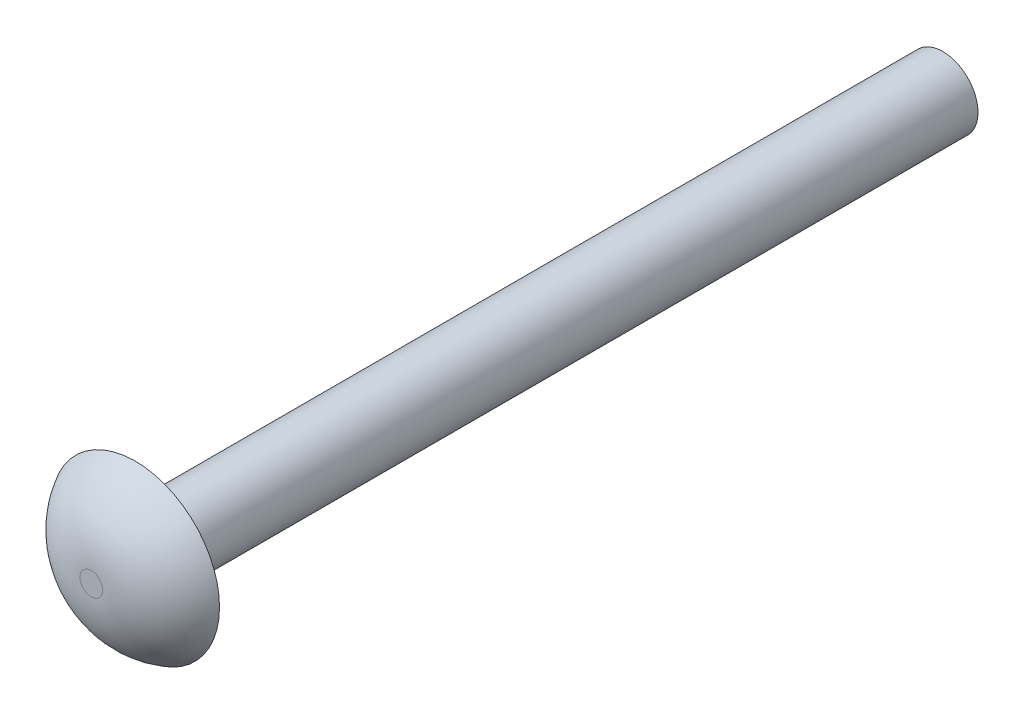
ISO-10303-21;
HEADER;
FILE_DESCRIPTION(('STEP AP214'),'2;1');
FILE_NAME('part.step','',(''),(''),'','','');
FILE_SCHEMA(('AUTOMOTIVE_DESIGN { 1 0 10303 214 1 1 1 1 }'));
ENDSEC;
DATA;
#1=APPLICATION_CONTEXT('core data for automotive mechanical design processes');
#2=APPLICATION_PROTOCOL_DEFINITION('international standard','automotive_design',2000,#1);
#3=PRODUCT_CONTEXT('',#1,'mechanical');
#4=PRODUCT('Part','Part','',(#3));
#5=PRODUCT_RELATED_PRODUCT_CATEGORY('part','',(#4));
#6=PRODUCT_DEFINITION_FORMATION('','',#4);
#7=PRODUCT_DEFINITION_CONTEXT('part definition',#1,'design');
#8=PRODUCT_DEFINITION('design','',#6,#7);
#9=PRODUCT_DEFINITION_SHAPE('','',#8);
#10=(LENGTH_UNIT() NAMED_UNIT(*) SI_UNIT(.MILLI.,.METRE.));
#11=(NAMED_UNIT(*) PLANE_ANGLE_UNIT() SI_UNIT($,.RADIAN.));
#12=(NAMED_UNIT(*) SI_UNIT($,.STERADIAN.) SOLID_ANGLE_UNIT());
#13=UNCERTAINTY_MEASURE_WITH_UNIT(LENGTH_MEASURE(1.E-05),#10,'distance_accuracy_value','');
#14=(GEOMETRIC_REPRESENTATION_CONTEXT(3) GLOBAL_UNCERTAINTY_ASSIGNED_CONTEXT((#13)) GLOBAL_UNIT_ASSIGNED_CONTEXT((#10,
#11,#12)) REPRESENTATION_CONTEXT('',''));
#15=CARTESIAN_POINT('',(0.,0.,0.));
#16=DIRECTION('',(0.,0.,1.));
#17=DIRECTION('',(1.,0.,0.));
#18=AXIS2_PLACEMENT_3D('',#15,#16,#17);
#19=CARTESIAN_POINT('',(-35.7051545505437,53.2948454494564,20.8));
#20=DIRECTION('',(0.,0.,-1.));
#21=DIRECTION('',(-0.998744511735788,-0.0500939145769443,0.));
#22=AXIS2_PLACEMENT_3D('',#19,#20,#21);
#23=DEGENERATE_TOROIDAL_SURFACE('',#22,0.646688068540962,4.7,.T.);
#24=CARTESIAN_POINT('',(-35.7051545505437,53.2948454494564,25.5));
#25=DIRECTION('',(0.,0.,1.));
#26=DIRECTION('',(0.998744511735788,0.0500939145769443,0.));
#27=AXIS2_PLACEMENT_3D('',#24,#25,#26);
#28=CIRCLE('',#27,0.646688068540963);
#29=CARTESIAN_POINT('',(-36.351030709804,53.2624503125929,25.5));
#30=VERTEX_POINT('',#29);
#31=EDGE_CURVE('E40',#30,#30,#28,.T.);
#32=ORIENTED_EDGE('',*,*,#31,.F.);
#33=EDGE_LOOP('',(#32));
#34=FACE_BOUND('',#33,.T.);
#35=CARTESIAN_POINT('',(-35.7051545505437,53.2948454494564,23.));
#36=DIRECTION('',(0.,0.,1.));
#37=DIRECTION('',(0.998744511735788,0.0500939145769443,0.));
#38=AXIS2_PLACEMENT_3D('',#35,#36,#37);
#39=CIRCLE('',#38,4.8);
#40=CARTESIAN_POINT('',(-40.4991282068754,53.054394659487,23.));
#41=VERTEX_POINT('',#40);
#42=EDGE_CURVE('E11',#41,#41,#39,.T.);
#43=ORIENTED_EDGE('',*,*,#42,.T.);
#44=EDGE_LOOP('',(#43));
#45=FACE_BOUND('',#44,.T.);
#46=ADVANCED_FACE('F16',(#34,#45),#23,.T.);
#47=CARTESIAN_POINT('',(-35.7051545505437,53.2948454494564,23.));
#48=DIRECTION('',(0.,0.,-1.));
#49=DIRECTION('',(-0.998744511735788,-0.0500939145769443,0.));
#50=AXIS2_PLACEMENT_3D('',#47,#48,#49);
#51=CYLINDRICAL_SURFACE('',#50,2.);
#52=CARTESIAN_POINT('',(-35.7051545505437,53.2948454494564,23.));
#53=DIRECTION('',(0.,0.,1.));
#54=DIRECTION('',(0.998744511735788,0.0500939145769443,0.));
#55=AXIS2_PLACEMENT_3D('',#52,#53,#54);
#56=CIRCLE('',#55,2.);
#57=CARTESIAN_POINT('',(-37.7026435740152,53.1946576203025,23.));
#58=VERTEX_POINT('',#57);
#59=EDGE_CURVE('E20',#58,#58,#56,.T.);
#60=ORIENTED_EDGE('',*,*,#59,.F.);
#61=EDGE_LOOP('',(#60));
#62=FACE_BOUND('',#61,.T.);
#63=CARTESIAN_POINT('',(-35.7051545505437,53.2948454494564,-23.));
#64=DIRECTION('',(0.,0.,1.));
#65=DIRECTION('',(0.998744511735788,0.0500939145769443,0.));
#66=AXIS2_PLACEMENT_3D('',#63,#64,#65);
#67=CIRCLE('',#66,2.);
#68=CARTESIAN_POINT('',(-37.7026435740152,53.1946576203025,-23.));
#69=VERTEX_POINT('',#68);
#70=EDGE_CURVE('E27',#69,#69,#67,.T.);
#71=ORIENTED_EDGE('',*,*,#70,.T.);
#72=EDGE_LOOP('',(#71));
#73=FACE_BOUND('',#72,.T.);
#74=ADVANCED_FACE('F56',(#62,#73),#51,.T.);
#75=CARTESIAN_POINT('',(-35.7051545505437,53.2948454494564,-23.));
#76=DIRECTION('',(0.,0.,1.));
#77=DIRECTION('',(-0.0500939145769443,0.998744511735788,0.));
#78=AXIS2_PLACEMENT_3D('',#75,#76,#77);
#79=PLANE('',#78);
#80=ORIENTED_EDGE('',*,*,#70,.F.);
#81=EDGE_LOOP('',(#80));
#82=FACE_BOUND('',#81,.T.);
#83=ADVANCED_FACE('F18',(#82),#79,.F.);
#84=CARTESIAN_POINT('',(-35.7051545505437,53.2948454494564,23.));
#85=DIRECTION('',(0.,0.,1.));
#86=DIRECTION('',(-0.0500939145769443,0.998744511735788,0.));
#87=AXIS2_PLACEMENT_3D('',#84,#85,#86);
#88=PLANE('',#87);
#89=ORIENTED_EDGE('',*,*,#42,.F.);
#90=EDGE_LOOP('',(#89));
#91=FACE_BOUND('',#90,.T.);
#92=ORIENTED_EDGE('',*,*,#59,.T.);
#93=EDGE_LOOP('',(#92));
#94=FACE_BOUND('',#93,.T.);
#95=ADVANCED_FACE('F71',(#91,#94),#88,.F.);
#96=CARTESIAN_POINT('',(-35.7051545505437,53.2948454494564,25.5));
#97=DIRECTION('',(0.,0.,1.));
#98=DIRECTION('',(-0.0500939145769443,0.998744511735788,0.));
#99=AXIS2_PLACEMENT_3D('',#96,#97,#98);
#100=PLANE('',#99);
#101=ORIENTED_EDGE('',*,*,#31,.T.);
#102=EDGE_LOOP('',(#101));
#103=FACE_BOUND('',#102,.T.);
#104=ADVANCED_FACE('F69',(#103),#100,.T.);
#105=CLOSED_SHELL('',(#46,#74,#83,#95,#104));
#106=MANIFOLD_SOLID_BREP('B1',#105);
#107=ADVANCED_BREP_SHAPE_REPRESENTATION('',(#18,#106),#14);
#108=SHAPE_DEFINITION_REPRESENTATION(#9,#107);
ENDSEC;
END-ISO-10303-21;
